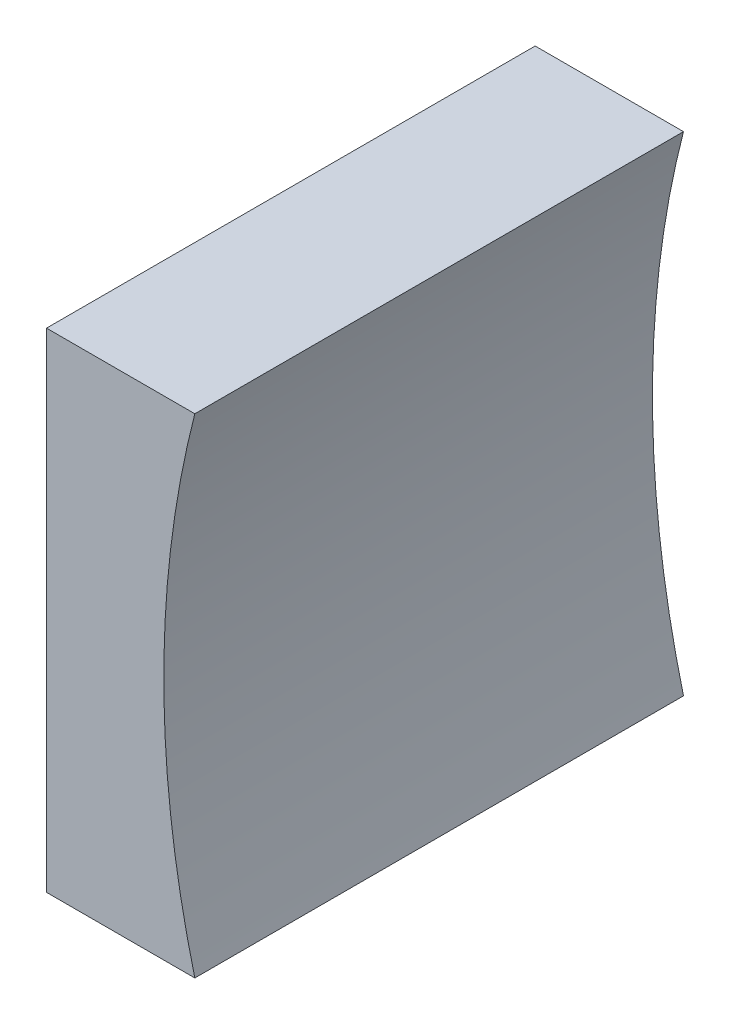
ISO-10303-21;
HEADER;
FILE_DESCRIPTION(('STEP AP214'),'2;1');
FILE_NAME('part.step','',(''),(''),'','','');
FILE_SCHEMA(('AUTOMOTIVE_DESIGN { 1 0 10303 214 1 1 1 1 }'));
ENDSEC;
DATA;
#1=APPLICATION_CONTEXT('core data for automotive mechanical design processes');
#2=APPLICATION_PROTOCOL_DEFINITION('international standard','automotive_design',2000,#1);
#3=PRODUCT_CONTEXT('',#1,'mechanical');
#4=PRODUCT('Part','Part','',(#3));
#5=PRODUCT_RELATED_PRODUCT_CATEGORY('part','',(#4));
#6=PRODUCT_DEFINITION_FORMATION('','',#4);
#7=PRODUCT_DEFINITION_CONTEXT('part definition',#1,'design');
#8=PRODUCT_DEFINITION('design','',#6,#7);
#9=PRODUCT_DEFINITION_SHAPE('','',#8);
#10=(LENGTH_UNIT() NAMED_UNIT(*) SI_UNIT(.MILLI.,.METRE.));
#11=(NAMED_UNIT(*) PLANE_ANGLE_UNIT() SI_UNIT($,.RADIAN.));
#12=(NAMED_UNIT(*) SI_UNIT($,.STERADIAN.) SOLID_ANGLE_UNIT());
#13=UNCERTAINTY_MEASURE_WITH_UNIT(LENGTH_MEASURE(1.E-05),#10,'distance_accuracy_value','');
#14=(GEOMETRIC_REPRESENTATION_CONTEXT(3) GLOBAL_UNCERTAINTY_ASSIGNED_CONTEXT((#13)) GLOBAL_UNIT_ASSIGNED_CONTEXT((#10,
#11,#12)) REPRESENTATION_CONTEXT('',''));
#15=CARTESIAN_POINT('',(0.,0.,0.));
#16=DIRECTION('',(0.,0.,1.));
#17=DIRECTION('',(1.,0.,0.));
#18=AXIS2_PLACEMENT_3D('',#15,#16,#17);
#19=CARTESIAN_POINT('',(292.294843803561,54.3579292677671,25.));
#20=DIRECTION('',(0.,1.,0.));
#21=DIRECTION('',(-1.,0.,0.));
#22=AXIS2_PLACEMENT_3D('',#19,#20,#21);
#23=PLANE('',#22);
#24=DIRECTION('',(1.,0.,0.));
#25=VECTOR('',#24,1.);
#26=CARTESIAN_POINT('',(292.294843803561,54.3579292677671,0.));
#27=LINE('',#26,#25);
#28=CARTESIAN_POINT('',(284.707135631282,54.3579292677671,0.));
#29=VERTEX_POINT('',#28);
#30=CARTESIAN_POINT('',(292.294843803561,54.3579292677671,0.));
#31=VERTEX_POINT('',#30);
#32=EDGE_CURVE('E91',#29,#31,#27,.T.);
#33=ORIENTED_EDGE('',*,*,#32,.T.);
#34=DIRECTION('',(0.,0.,-1.));
#35=VECTOR('',#34,1.);
#36=CARTESIAN_POINT('',(292.294843803561,54.3579292677671,25.));
#37=LINE('',#36,#35);
#38=CARTESIAN_POINT('',(292.294843803561,54.3579292677671,25.));
#39=VERTEX_POINT('',#38);
#40=EDGE_CURVE('E45',#39,#31,#37,.T.);
#41=ORIENTED_EDGE('',*,*,#40,.F.);
#42=DIRECTION('',(1.,0.,0.));
#43=VECTOR('',#42,1.);
#44=CARTESIAN_POINT('',(292.294843803561,54.3579292677671,25.));
#45=LINE('',#44,#43);
#46=CARTESIAN_POINT('',(284.707135631282,54.3579292677671,25.));
#47=VERTEX_POINT('',#46);
#48=EDGE_CURVE('E84',#47,#39,#45,.T.);
#49=ORIENTED_EDGE('',*,*,#48,.F.);
#50=DIRECTION('',(0.,0.,-1.));
#51=VECTOR('',#50,1.);
#52=CARTESIAN_POINT('',(284.707135631282,54.3579292677671,25.));
#53=LINE('',#52,#51);
#54=EDGE_CURVE('E11',#47,#29,#53,.T.);
#55=ORIENTED_EDGE('',*,*,#54,.T.);
#56=EDGE_LOOP('',(#33,#41,#49,#55));
#57=FACE_BOUND('',#56,.T.);
#58=ADVANCED_FACE('F37',(#57),#23,.F.);
#59=CARTESIAN_POINT('',(340.707135631153,66.857929267767,25.));
#60=DIRECTION('',(0.,0.,-1.));
#61=DIRECTION('',(-1.,0.,0.));
#62=AXIS2_PLACEMENT_3D('',#59,#60,#61);
#63=CYLINDRICAL_SURFACE('',#62,50.);
#64=CARTESIAN_POINT('',(340.707135631153,66.857929267767,0.));
#65=DIRECTION('',(0.,0.,-1.));
#66=DIRECTION('',(1.,0.,0.));
#67=AXIS2_PLACEMENT_3D('',#64,#65,#66);
#68=CIRCLE('',#67,50.);
#69=CARTESIAN_POINT('',(292.294843803561,79.3579292677671,0.));
#70=VERTEX_POINT('',#69);
#71=EDGE_CURVE('E71',#31,#70,#68,.T.);
#72=ORIENTED_EDGE('',*,*,#71,.T.);
#73=DIRECTION('',(0.,0.,-1.));
#74=VECTOR('',#73,1.);
#75=CARTESIAN_POINT('',(292.294843803561,79.3579292677671,25.));
#76=LINE('',#75,#74);
#77=CARTESIAN_POINT('',(292.294843803561,79.3579292677671,25.));
#78=VERTEX_POINT('',#77);
#79=EDGE_CURVE('E92',#78,#70,#76,.T.);
#80=ORIENTED_EDGE('',*,*,#79,.F.);
#81=CARTESIAN_POINT('',(340.707135631153,66.857929267767,25.));
#82=DIRECTION('',(0.,0.,-1.));
#83=DIRECTION('',(1.,0.,0.));
#84=AXIS2_PLACEMENT_3D('',#81,#82,#83);
#85=CIRCLE('',#84,50.);
#86=EDGE_CURVE('E88',#39,#78,#85,.T.);
#87=ORIENTED_EDGE('',*,*,#86,.F.);
#88=ORIENTED_EDGE('',*,*,#40,.T.);
#89=EDGE_LOOP('',(#72,#80,#87,#88));
#90=FACE_BOUND('',#89,.T.);
#91=ADVANCED_FACE('F93',(#90),#63,.F.);
#92=CARTESIAN_POINT('',(284.707135631282,79.3579292677671,25.));
#93=DIRECTION('',(0.,-1.,0.));
#94=DIRECTION('',(1.,0.,0.));
#95=AXIS2_PLACEMENT_3D('',#92,#93,#94);
#96=PLANE('',#95);
#97=DIRECTION('',(-1.,0.,0.));
#98=VECTOR('',#97,1.);
#99=CARTESIAN_POINT('',(284.707135631282,79.3579292677671,0.));
#100=LINE('',#99,#98);
#101=CARTESIAN_POINT('',(284.707135631282,79.3579292677671,0.));
#102=VERTEX_POINT('',#101);
#103=EDGE_CURVE('E78',#70,#102,#100,.T.);
#104=ORIENTED_EDGE('',*,*,#103,.T.);
#105=DIRECTION('',(0.,0.,-1.));
#106=VECTOR('',#105,1.);
#107=CARTESIAN_POINT('',(284.707135631282,79.3579292677671,25.));
#108=LINE('',#107,#106);
#109=CARTESIAN_POINT('',(284.707135631282,79.3579292677671,25.));
#110=VERTEX_POINT('',#109);
#111=EDGE_CURVE('E97',#110,#102,#108,.T.);
#112=ORIENTED_EDGE('',*,*,#111,.F.);
#113=DIRECTION('',(-1.,0.,0.));
#114=VECTOR('',#113,1.);
#115=CARTESIAN_POINT('',(284.707135631282,79.3579292677671,25.));
#116=LINE('',#115,#114);
#117=EDGE_CURVE('E95',#78,#110,#116,.T.);
#118=ORIENTED_EDGE('',*,*,#117,.F.);
#119=ORIENTED_EDGE('',*,*,#79,.T.);
#120=EDGE_LOOP('',(#104,#112,#118,#119));
#121=FACE_BOUND('',#120,.T.);
#122=ADVANCED_FACE('F107',(#121),#96,.F.);
#123=CARTESIAN_POINT('',(284.707135631282,66.8579292677671,25.));
#124=DIRECTION('',(1.,0.,0.));
#125=DIRECTION('',(0.,0.,-1.));
#126=AXIS2_PLACEMENT_3D('',#123,#124,#125);
#127=PLANE('',#126);
#128=DIRECTION('',(0.,-1.,0.));
#129=VECTOR('',#128,1.);
#130=CARTESIAN_POINT('',(284.707135631282,66.8579292677671,0.));
#131=LINE('',#130,#129);
#132=EDGE_CURVE('E104',#102,#29,#131,.T.);
#133=ORIENTED_EDGE('',*,*,#132,.T.);
#134=ORIENTED_EDGE('',*,*,#54,.F.);
#135=DIRECTION('',(0.,-1.,0.));
#136=VECTOR('',#135,1.);
#137=CARTESIAN_POINT('',(284.707135631282,54.3579292677671,25.));
#138=LINE('',#137,#136);
#139=EDGE_CURVE('E53',#110,#47,#138,.T.);
#140=ORIENTED_EDGE('',*,*,#139,.F.);
#141=ORIENTED_EDGE('',*,*,#111,.T.);
#142=EDGE_LOOP('',(#133,#134,#140,#141));
#143=FACE_BOUND('',#142,.T.);
#144=ADVANCED_FACE('F111',(#143),#127,.F.);
#145=CARTESIAN_POINT('',(340.707135631153,66.857929267767,25.));
#146=DIRECTION('',(0.,0.,1.));
#147=DIRECTION('',(1.,0.,0.));
#148=AXIS2_PLACEMENT_3D('',#145,#146,#147);
#149=PLANE('',#148);
#150=ORIENTED_EDGE('',*,*,#139,.T.);
#151=ORIENTED_EDGE('',*,*,#48,.T.);
#152=ORIENTED_EDGE('',*,*,#86,.T.);
#153=ORIENTED_EDGE('',*,*,#117,.T.);
#154=EDGE_LOOP('',(#150,#151,#152,#153));
#155=FACE_BOUND('',#154,.T.);
#156=ADVANCED_FACE('F86',(#155),#149,.T.);
#157=CARTESIAN_POINT('',(340.707135631153,66.857929267767,0.));
#158=DIRECTION('',(0.,0.,1.));
#159=DIRECTION('',(1.,0.,0.));
#160=AXIS2_PLACEMENT_3D('',#157,#158,#159);
#161=PLANE('',#160);
#162=ORIENTED_EDGE('',*,*,#32,.F.);
#163=ORIENTED_EDGE('',*,*,#132,.F.);
#164=ORIENTED_EDGE('',*,*,#103,.F.);
#165=ORIENTED_EDGE('',*,*,#71,.F.);
#166=EDGE_LOOP('',(#162,#163,#164,#165));
#167=FACE_BOUND('',#166,.T.);
#168=ADVANCED_FACE('F110',(#167),#161,.F.);
#169=CLOSED_SHELL('',(#58,#91,#122,#144,#156,#168));
#170=MANIFOLD_SOLID_BREP('B2',#169);
#171=ADVANCED_BREP_SHAPE_REPRESENTATION('',(#18,#170),#14);
#172=SHAPE_DEFINITION_REPRESENTATION(#9,#171);
ENDSEC;
END-ISO-10303-21;
